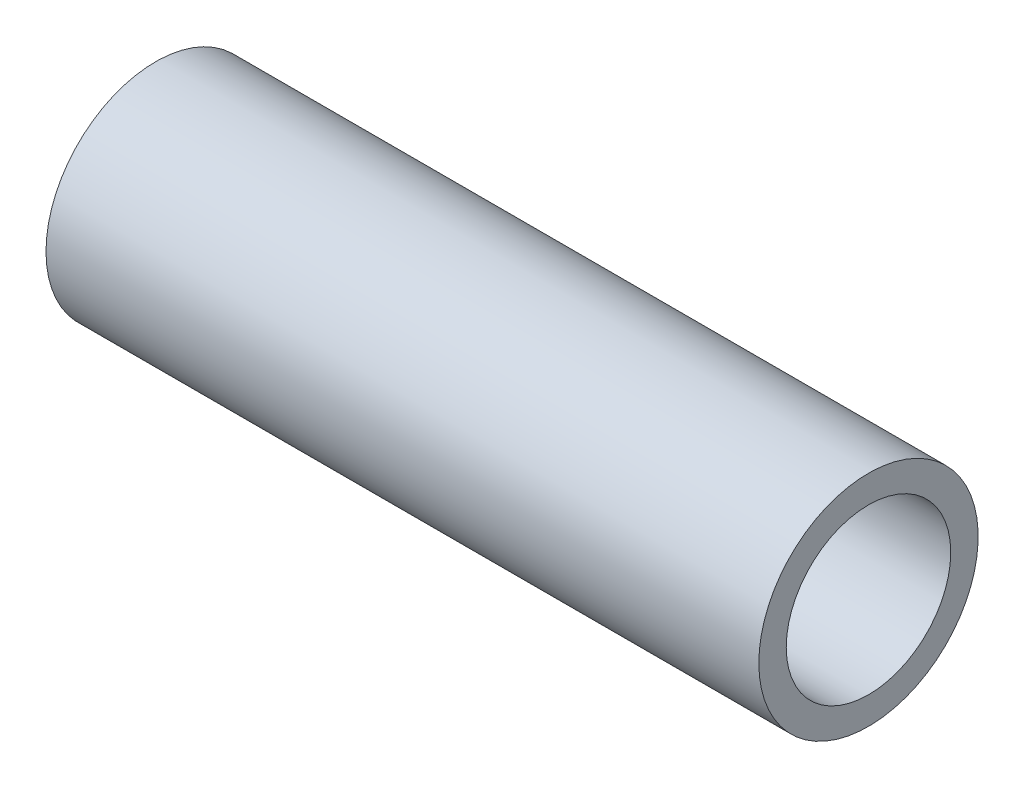
ISO-10303-21;
HEADER;
FILE_DESCRIPTION(('STEP AP214'),'2;1');
FILE_NAME('part.step','',(''),(''),'','','');
FILE_SCHEMA(('AUTOMOTIVE_DESIGN { 1 0 10303 214 1 1 1 1 }'));
ENDSEC;
DATA;
#1=APPLICATION_CONTEXT('core data for automotive mechanical design processes');
#2=APPLICATION_PROTOCOL_DEFINITION('international standard','automotive_design',2000,#1);
#3=PRODUCT_CONTEXT('',#1,'mechanical');
#4=PRODUCT('Part','Part','',(#3));
#5=PRODUCT_RELATED_PRODUCT_CATEGORY('part','',(#4));
#6=PRODUCT_DEFINITION_FORMATION('','',#4);
#7=PRODUCT_DEFINITION_CONTEXT('part definition',#1,'design');
#8=PRODUCT_DEFINITION('design','',#6,#7);
#9=PRODUCT_DEFINITION_SHAPE('','',#8);
#10=(LENGTH_UNIT() NAMED_UNIT(*) SI_UNIT(.MILLI.,.METRE.));
#11=(NAMED_UNIT(*) PLANE_ANGLE_UNIT() SI_UNIT($,.RADIAN.));
#12=(NAMED_UNIT(*) SI_UNIT($,.STERADIAN.) SOLID_ANGLE_UNIT());
#13=UNCERTAINTY_MEASURE_WITH_UNIT(LENGTH_MEASURE(1.E-05),#10,'distance_accuracy_value','');
#14=(GEOMETRIC_REPRESENTATION_CONTEXT(3) GLOBAL_UNCERTAINTY_ASSIGNED_CONTEXT((#13)) GLOBAL_UNIT_ASSIGNED_CONTEXT((#10,
#11,#12)) REPRESENTATION_CONTEXT('',''));
#15=CARTESIAN_POINT('',(0.,0.,0.));
#16=DIRECTION('',(0.,0.,1.));
#17=DIRECTION('',(1.,0.,0.));
#18=AXIS2_PLACEMENT_3D('',#15,#16,#17);
#19=CARTESIAN_POINT('',(-6.5,0.,0.));
#20=DIRECTION('',(1.,0.,0.));
#21=DIRECTION('',(0.,0.,-1.));
#22=AXIS2_PLACEMENT_3D('',#19,#20,#21);
#23=PLANE('',#22);
#24=CARTESIAN_POINT('',(-6.5,0.,0.));
#25=DIRECTION('',(-1.,0.,0.));
#26=DIRECTION('',(0.,0.,1.));
#27=AXIS2_PLACEMENT_3D('',#24,#25,#26);
#28=CIRCLE('',#27,2.);
#29=CARTESIAN_POINT('',(-6.5,0.,2.));
#30=VERTEX_POINT('',#29);
#31=EDGE_CURVE('E11',#30,#30,#28,.T.);
#32=ORIENTED_EDGE('',*,*,#31,.T.);
#33=EDGE_LOOP('',(#32));
#34=FACE_BOUND('',#33,.T.);
#35=ADVANCED_FACE('F31',(#34),#23,.F.);
#36=CARTESIAN_POINT('',(-6.,0.,0.));
#37=DIRECTION('',(-1.,0.,0.));
#38=DIRECTION('',(0.,0.,1.));
#39=AXIS2_PLACEMENT_3D('',#36,#37,#38);
#40=CYLINDRICAL_SURFACE('',#39,2.);
#41=ORIENTED_EDGE('',*,*,#31,.F.);
#42=EDGE_LOOP('',(#41));
#43=FACE_BOUND('',#42,.T.);
#44=CARTESIAN_POINT('',(6.5,0.,0.));
#45=DIRECTION('',(-1.,0.,0.));
#46=DIRECTION('',(0.,0.,1.));
#47=AXIS2_PLACEMENT_3D('',#44,#45,#46);
#48=CIRCLE('',#47,2.);
#49=CARTESIAN_POINT('',(6.5,0.,2.));
#50=VERTEX_POINT('',#49);
#51=EDGE_CURVE('E37',#50,#50,#48,.T.);
#52=ORIENTED_EDGE('',*,*,#51,.T.);
#53=EDGE_LOOP('',(#52));
#54=FACE_BOUND('',#53,.T.);
#55=ADVANCED_FACE('F53',(#43,#54),#40,.T.);
#56=CARTESIAN_POINT('',(6.5,0.,-1.5));
#57=DIRECTION('',(-1.,0.,0.));
#58=DIRECTION('',(0.,0.,1.));
#59=AXIS2_PLACEMENT_3D('',#56,#57,#58);
#60=PLANE('',#59);
#61=ORIENTED_EDGE('',*,*,#51,.F.);
#62=EDGE_LOOP('',(#61));
#63=FACE_BOUND('',#62,.T.);
#64=CARTESIAN_POINT('',(6.5,0.,0.));
#65=DIRECTION('',(-1.,0.,0.));
#66=DIRECTION('',(0.,0.,1.));
#67=AXIS2_PLACEMENT_3D('',#64,#65,#66);
#68=CIRCLE('',#67,1.5);
#69=CARTESIAN_POINT('',(6.5,0.,1.5));
#70=VERTEX_POINT('',#69);
#71=EDGE_CURVE('E64',#70,#70,#68,.T.);
#72=ORIENTED_EDGE('',*,*,#71,.T.);
#73=EDGE_LOOP('',(#72));
#74=FACE_BOUND('',#73,.T.);
#75=ADVANCED_FACE('F48',(#63,#74),#60,.F.);
#76=CARTESIAN_POINT('',(-6.,0.,0.));
#77=DIRECTION('',(-1.,0.,0.));
#78=DIRECTION('',(0.,0.,1.));
#79=AXIS2_PLACEMENT_3D('',#76,#77,#78);
#80=CYLINDRICAL_SURFACE('',#79,1.5);
#81=ORIENTED_EDGE('',*,*,#71,.F.);
#82=EDGE_LOOP('',(#81));
#83=FACE_BOUND('',#82,.T.);
#84=CARTESIAN_POINT('',(-5.59807621135332,0.,0.));
#85=DIRECTION('',(-1.,0.,0.));
#86=DIRECTION('',(0.,0.,1.));
#87=AXIS2_PLACEMENT_3D('',#84,#85,#86);
#88=CIRCLE('',#87,1.5);
#89=CARTESIAN_POINT('',(-5.59807621135332,0.,1.5));
#90=VERTEX_POINT('',#89);
#91=EDGE_CURVE('E66',#90,#90,#88,.T.);
#92=ORIENTED_EDGE('',*,*,#91,.T.);
#93=EDGE_LOOP('',(#92));
#94=FACE_BOUND('',#93,.T.);
#95=ADVANCED_FACE('F42',(#83,#94),#80,.F.);
#96=CARTESIAN_POINT('',(-6.,0.,0.));
#97=DIRECTION('',(1.,0.,0.));
#98=DIRECTION('',(0.,0.,-1.));
#99=AXIS2_PLACEMENT_3D('',#96,#97,#98);
#100=CONICAL_SURFACE('',#99,0.,1.30899693899575);
#101=ORIENTED_EDGE('',*,*,#91,.F.);
#102=EDGE_LOOP('',(#101));
#103=FACE_BOUND('',#102,.T.);
#104=CARTESIAN_POINT('',(-6.,0.,0.));
#105=VERTEX_POINT('',#104);
#106=VERTEX_LOOP('',#105);
#107=FACE_BOUND('',#106,.T.);
#108=ADVANCED_FACE('F40',(#103,#107),#100,.F.);
#109=CLOSED_SHELL('',(#35,#55,#75,#95,#108));
#110=MANIFOLD_SOLID_BREP('B2',#109);
#111=ADVANCED_BREP_SHAPE_REPRESENTATION('',(#18,#110),#14);
#112=SHAPE_DEFINITION_REPRESENTATION(#9,#111);
ENDSEC;
END-ISO-10303-21;
